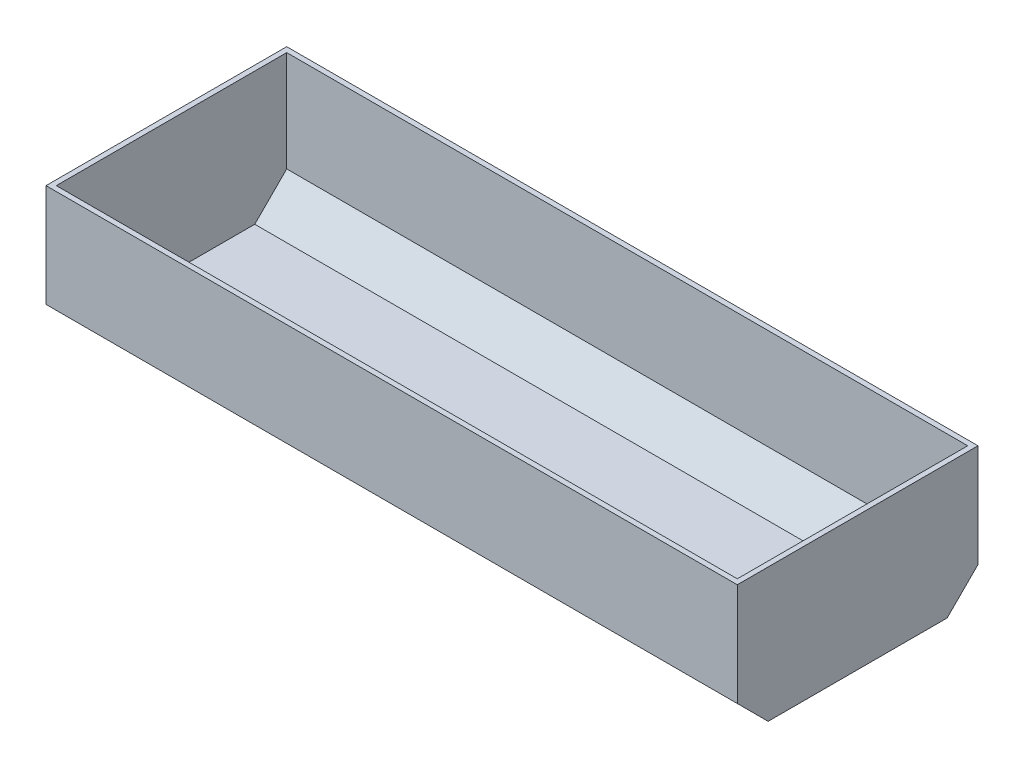
ISO-10303-21;
HEADER;
FILE_DESCRIPTION(('STEP AP214'),'2;1');
FILE_NAME('part.step','',(''),(''),'','','');
FILE_SCHEMA(('AUTOMOTIVE_DESIGN { 1 0 10303 214 1 1 1 1 }'));
ENDSEC;
DATA;
#1=APPLICATION_CONTEXT('core data for automotive mechanical design processes');
#2=APPLICATION_PROTOCOL_DEFINITION('international standard','automotive_design',2000,#1);
#3=PRODUCT_CONTEXT('',#1,'mechanical');
#4=PRODUCT('Part','Part','',(#3));
#5=PRODUCT_RELATED_PRODUCT_CATEGORY('part','',(#4));
#6=PRODUCT_DEFINITION_FORMATION('','',#4);
#7=PRODUCT_DEFINITION_CONTEXT('part definition',#1,'design');
#8=PRODUCT_DEFINITION('design','',#6,#7);
#9=PRODUCT_DEFINITION_SHAPE('','',#8);
#10=(LENGTH_UNIT() NAMED_UNIT(*) SI_UNIT(.MILLI.,.METRE.));
#11=(NAMED_UNIT(*) PLANE_ANGLE_UNIT() SI_UNIT($,.RADIAN.));
#12=(NAMED_UNIT(*) SI_UNIT($,.STERADIAN.) SOLID_ANGLE_UNIT());
#13=UNCERTAINTY_MEASURE_WITH_UNIT(LENGTH_MEASURE(1.E-05),#10,'distance_accuracy_value','');
#14=(GEOMETRIC_REPRESENTATION_CONTEXT(3) GLOBAL_UNCERTAINTY_ASSIGNED_CONTEXT((#13)) GLOBAL_UNIT_ASSIGNED_CONTEXT((#10,
#11,#12)) REPRESENTATION_CONTEXT('',''));
#15=CARTESIAN_POINT('',(0.,0.,0.));
#16=DIRECTION('',(0.,0.,1.));
#17=DIRECTION('',(1.,0.,0.));
#18=AXIS2_PLACEMENT_3D('',#15,#16,#17);
#19=CARTESIAN_POINT('',(3360.,1300.,-1170.));
#20=DIRECTION('',(-1.,0.,0.));
#21=DIRECTION('',(0.,0.,1.));
#22=AXIS2_PLACEMENT_3D('',#19,#20,#21);
#23=PLANE('',#22);
#24=DIRECTION('',(0.,0.,-1.));
#25=VECTOR('',#24,1.);
#26=CARTESIAN_POINT('',(3360.,0.,-1170.));
#27=LINE('',#26,#25);
#28=CARTESIAN_POINT('',(3360.,0.,869.999999999998));
#29=VERTEX_POINT('',#28);
#30=CARTESIAN_POINT('',(3360.,0.,-869.999999999999));
#31=VERTEX_POINT('',#30);
#32=EDGE_CURVE('E171',#29,#31,#27,.T.);
#33=ORIENTED_EDGE('',*,*,#32,.T.);
#34=DIRECTION('',(0.,-0.707106781186546,0.707106781186549));
#35=VECTOR('',#34,1.);
#36=CARTESIAN_POINT('',(3360.,300.,-1170.));
#37=LINE('',#36,#35);
#38=CARTESIAN_POINT('',(3360.,300.,-1170.));
#39=VERTEX_POINT('',#38);
#40=EDGE_CURVE('E45',#31,#39,#37,.F.);
#41=ORIENTED_EDGE('',*,*,#40,.T.);
#42=DIRECTION('',(0.,-1.,0.));
#43=VECTOR('',#42,1.);
#44=CARTESIAN_POINT('',(3360.,1300.,-1170.));
#45=LINE('',#44,#43);
#46=CARTESIAN_POINT('',(3360.,1300.,-1170.));
#47=VERTEX_POINT('',#46);
#48=EDGE_CURVE('E204',#47,#39,#45,.T.);
#49=ORIENTED_EDGE('',*,*,#48,.F.);
#50=DIRECTION('',(0.,0.,-1.));
#51=VECTOR('',#50,1.);
#52=CARTESIAN_POINT('',(3360.,1300.,-1170.));
#53=LINE('',#52,#51);
#54=CARTESIAN_POINT('',(3360.,1300.,1170.));
#55=VERTEX_POINT('',#54);
#56=EDGE_CURVE('E181',#55,#47,#53,.T.);
#57=ORIENTED_EDGE('',*,*,#56,.F.);
#58=DIRECTION('',(0.,-1.,0.));
#59=VECTOR('',#58,1.);
#60=CARTESIAN_POINT('',(3360.,1300.,1170.));
#61=LINE('',#60,#59);
#62=CARTESIAN_POINT('',(3360.,300.000000000001,1170.));
#63=VERTEX_POINT('',#62);
#64=EDGE_CURVE('E191',#55,#63,#61,.T.);
#65=ORIENTED_EDGE('',*,*,#64,.T.);
#66=DIRECTION('',(0.,0.707106781186546,0.707106781186549));
#67=VECTOR('',#66,1.);
#68=CARTESIAN_POINT('',(3360.,300.000000000001,1170.));
#69=LINE('',#68,#67);
#70=EDGE_CURVE('E60',#63,#29,#69,.F.);
#71=ORIENTED_EDGE('',*,*,#70,.T.);
#72=EDGE_LOOP('',(#33,#41,#49,#57,#65,#71));
#73=FACE_BOUND('',#72,.T.);
#74=ADVANCED_FACE('F36',(#73),#23,.F.);
#75=CARTESIAN_POINT('',(-3360.,1300.,-1170.));
#76=DIRECTION('',(0.,0.,1.));
#77=DIRECTION('',(1.,0.,0.));
#78=AXIS2_PLACEMENT_3D('',#75,#76,#77);
#79=PLANE('',#78);
#80=ORIENTED_EDGE('',*,*,#48,.T.);
#81=DIRECTION('',(-1.,0.,0.));
#82=VECTOR('',#81,1.);
#83=CARTESIAN_POINT('',(-3360.,300.,-1170.));
#84=LINE('',#83,#82);
#85=CARTESIAN_POINT('',(-3360.,300.,-1170.));
#86=VERTEX_POINT('',#85);
#87=EDGE_CURVE('E207',#39,#86,#84,.T.);
#88=ORIENTED_EDGE('',*,*,#87,.T.);
#89=DIRECTION('',(0.,-1.,0.));
#90=VECTOR('',#89,1.);
#91=CARTESIAN_POINT('',(-3360.,1300.,-1170.));
#92=LINE('',#91,#90);
#93=CARTESIAN_POINT('',(-3360.,1300.,-1170.));
#94=VERTEX_POINT('',#93);
#95=EDGE_CURVE('E201',#94,#86,#92,.T.);
#96=ORIENTED_EDGE('',*,*,#95,.F.);
#97=DIRECTION('',(-1.,0.,0.));
#98=VECTOR('',#97,1.);
#99=CARTESIAN_POINT('',(-3360.,1300.,-1170.));
#100=LINE('',#99,#98);
#101=EDGE_CURVE('E184',#47,#94,#100,.T.);
#102=ORIENTED_EDGE('',*,*,#101,.F.);
#103=EDGE_LOOP('',(#80,#88,#96,#102));
#104=FACE_BOUND('',#103,.T.);
#105=ADVANCED_FACE('F227',(#104),#79,.F.);
#106=CARTESIAN_POINT('',(-3360.,1300.,-1170.));
#107=DIRECTION('',(1.,0.,0.));
#108=DIRECTION('',(0.,0.,-1.));
#109=AXIS2_PLACEMENT_3D('',#106,#107,#108);
#110=PLANE('',#109);
#111=ORIENTED_EDGE('',*,*,#95,.T.);
#112=DIRECTION('',(0.,0.707106781186546,-0.707106781186549));
#113=VECTOR('',#112,1.);
#114=CARTESIAN_POINT('',(-3360.,300.,-1170.));
#115=LINE('',#114,#113);
#116=CARTESIAN_POINT('',(-3360.,0.,-869.999999999999));
#117=VERTEX_POINT('',#116);
#118=EDGE_CURVE('E212',#86,#117,#115,.F.);
#119=ORIENTED_EDGE('',*,*,#118,.T.);
#120=DIRECTION('',(0.,0.,1.));
#121=VECTOR('',#120,1.);
#122=CARTESIAN_POINT('',(-3360.,0.,-1170.));
#123=LINE('',#122,#121);
#124=CARTESIAN_POINT('',(-3360.,0.,869.999999999998));
#125=VERTEX_POINT('',#124);
#126=EDGE_CURVE('E185',#117,#125,#123,.T.);
#127=ORIENTED_EDGE('',*,*,#126,.T.);
#128=DIRECTION('',(0.,-0.707106781186546,-0.707106781186549));
#129=VECTOR('',#128,1.);
#130=CARTESIAN_POINT('',(-3360.,300.000000000001,1170.));
#131=LINE('',#130,#129);
#132=CARTESIAN_POINT('',(-3360.,300.000000000001,1170.));
#133=VERTEX_POINT('',#132);
#134=EDGE_CURVE('E210',#125,#133,#131,.F.);
#135=ORIENTED_EDGE('',*,*,#134,.T.);
#136=DIRECTION('',(0.,-1.,0.));
#137=VECTOR('',#136,1.);
#138=CARTESIAN_POINT('',(-3360.,1300.,1170.));
#139=LINE('',#138,#137);
#140=CARTESIAN_POINT('',(-3360.,1300.,1170.));
#141=VERTEX_POINT('',#140);
#142=EDGE_CURVE('E198',#141,#133,#139,.T.);
#143=ORIENTED_EDGE('',*,*,#142,.F.);
#144=DIRECTION('',(0.,0.,1.));
#145=VECTOR('',#144,1.);
#146=CARTESIAN_POINT('',(-3360.,1300.,-1170.));
#147=LINE('',#146,#145);
#148=EDGE_CURVE('E187',#94,#141,#147,.T.);
#149=ORIENTED_EDGE('',*,*,#148,.F.);
#150=EDGE_LOOP('',(#111,#119,#127,#135,#143,#149));
#151=FACE_BOUND('',#150,.T.);
#152=ADVANCED_FACE('F232',(#151),#110,.F.);
#153=CARTESIAN_POINT('',(-3360.,1300.,1170.));
#154=DIRECTION('',(0.,0.,-1.));
#155=DIRECTION('',(-1.,0.,0.));
#156=AXIS2_PLACEMENT_3D('',#153,#154,#155);
#157=PLANE('',#156);
#158=ORIENTED_EDGE('',*,*,#142,.T.);
#159=DIRECTION('',(1.,0.,0.));
#160=VECTOR('',#159,1.);
#161=CARTESIAN_POINT('',(-3360.,300.000000000001,1170.));
#162=LINE('',#161,#160);
#163=EDGE_CURVE('E11',#133,#63,#162,.T.);
#164=ORIENTED_EDGE('',*,*,#163,.T.);
#165=ORIENTED_EDGE('',*,*,#64,.F.);
#166=DIRECTION('',(1.,0.,0.));
#167=VECTOR('',#166,1.);
#168=CARTESIAN_POINT('',(-3360.,1300.,1170.));
#169=LINE('',#168,#167);
#170=EDGE_CURVE('E189',#141,#55,#169,.T.);
#171=ORIENTED_EDGE('',*,*,#170,.F.);
#172=EDGE_LOOP('',(#158,#164,#165,#171));
#173=FACE_BOUND('',#172,.T.);
#174=ADVANCED_FACE('F240',(#173),#157,.F.);
#175=CARTESIAN_POINT('',(0.,1300.,0.));
#176=DIRECTION('',(0.,1.,0.));
#177=DIRECTION('',(0.,0.,1.));
#178=AXIS2_PLACEMENT_3D('',#175,#176,#177);
#179=PLANE('',#178);
#180=DIRECTION('',(0.,0.,-1.));
#181=VECTOR('',#180,1.);
#182=CARTESIAN_POINT('',(3310.,1300.,-1170.));
#183=LINE('',#182,#181);
#184=CARTESIAN_POINT('',(3310.,1300.,1120.));
#185=VERTEX_POINT('',#184);
#186=CARTESIAN_POINT('',(3310.,1300.,-1120.));
#187=VERTEX_POINT('',#186);
#188=EDGE_CURVE('E146',#185,#187,#183,.T.);
#189=ORIENTED_EDGE('',*,*,#188,.F.);
#190=DIRECTION('',(1.,0.,0.));
#191=VECTOR('',#190,1.);
#192=CARTESIAN_POINT('',(-3360.,1300.,1120.));
#193=LINE('',#192,#191);
#194=CARTESIAN_POINT('',(-3310.,1300.,1120.));
#195=VERTEX_POINT('',#194);
#196=EDGE_CURVE('E179',#195,#185,#193,.T.);
#197=ORIENTED_EDGE('',*,*,#196,.F.);
#198=DIRECTION('',(0.,0.,1.));
#199=VECTOR('',#198,1.);
#200=CARTESIAN_POINT('',(-3310.,1300.,-1170.));
#201=LINE('',#200,#199);
#202=CARTESIAN_POINT('',(-3310.,1300.,-1120.));
#203=VERTEX_POINT('',#202);
#204=EDGE_CURVE('E177',#203,#195,#201,.T.);
#205=ORIENTED_EDGE('',*,*,#204,.F.);
#206=DIRECTION('',(-1.,0.,0.));
#207=VECTOR('',#206,1.);
#208=CARTESIAN_POINT('',(-3360.,1300.,-1120.));
#209=LINE('',#208,#207);
#210=EDGE_CURVE('E175',#187,#203,#209,.T.);
#211=ORIENTED_EDGE('',*,*,#210,.F.);
#212=EDGE_LOOP('',(#189,#197,#205,#211));
#213=FACE_BOUND('',#212,.T.);
#214=ORIENTED_EDGE('',*,*,#56,.T.);
#215=ORIENTED_EDGE('',*,*,#101,.T.);
#216=ORIENTED_EDGE('',*,*,#148,.T.);
#217=ORIENTED_EDGE('',*,*,#170,.T.);
#218=EDGE_LOOP('',(#214,#215,#216,#217));
#219=FACE_BOUND('',#218,.T.);
#220=ADVANCED_FACE('F243',(#213,#219),#179,.T.);
#221=CARTESIAN_POINT('',(0.,0.,0.));
#222=DIRECTION('',(0.,1.,0.));
#223=DIRECTION('',(0.,0.,1.));
#224=AXIS2_PLACEMENT_3D('',#221,#222,#223);
#225=PLANE('',#224);
#226=ORIENTED_EDGE('',*,*,#126,.F.);
#227=DIRECTION('',(1.,0.,0.));
#228=VECTOR('',#227,1.);
#229=CARTESIAN_POINT('',(0.,0.,-869.999999999999));
#230=LINE('',#229,#228);
#231=EDGE_CURVE('E216',#117,#31,#230,.T.);
#232=ORIENTED_EDGE('',*,*,#231,.T.);
#233=ORIENTED_EDGE('',*,*,#32,.F.);
#234=DIRECTION('',(-1.,0.,0.));
#235=VECTOR('',#234,1.);
#236=CARTESIAN_POINT('',(0.,0.,869.999999999998));
#237=LINE('',#236,#235);
#238=EDGE_CURVE('E214',#29,#125,#237,.T.);
#239=ORIENTED_EDGE('',*,*,#238,.T.);
#240=EDGE_LOOP('',(#226,#232,#233,#239));
#241=FACE_BOUND('',#240,.T.);
#242=ADVANCED_FACE('F236',(#241),#225,.F.);
#243=CARTESIAN_POINT('',(-3360.,300.,-1170.));
#244=DIRECTION('',(0.,0.707106781186549,0.707106781186546));
#245=DIRECTION('',(-1.,0.,0.));
#246=AXIS2_PLACEMENT_3D('',#243,#244,#245);
#247=PLANE('',#246);
#248=ORIENTED_EDGE('',*,*,#40,.F.);
#249=ORIENTED_EDGE('',*,*,#231,.F.);
#250=ORIENTED_EDGE('',*,*,#118,.F.);
#251=ORIENTED_EDGE('',*,*,#87,.F.);
#252=EDGE_LOOP('',(#248,#249,#250,#251));
#253=FACE_BOUND('',#252,.T.);
#254=ADVANCED_FACE('F229',(#253),#247,.F.);
#255=CARTESIAN_POINT('',(-3360.,300.000000000001,1170.));
#256=DIRECTION('',(0.,0.707106781186549,-0.707106781186547));
#257=DIRECTION('',(1.,0.,0.));
#258=AXIS2_PLACEMENT_3D('',#255,#256,#257);
#259=PLANE('',#258);
#260=ORIENTED_EDGE('',*,*,#134,.F.);
#261=ORIENTED_EDGE('',*,*,#238,.F.);
#262=ORIENTED_EDGE('',*,*,#70,.F.);
#263=ORIENTED_EDGE('',*,*,#163,.F.);
#264=EDGE_LOOP('',(#260,#261,#262,#263));
#265=FACE_BOUND('',#264,.T.);
#266=ADVANCED_FACE('F39',(#265),#259,.F.);
#267=CARTESIAN_POINT('',(3310.,1300.,-1170.));
#268=DIRECTION('',(-1.,0.,0.));
#269=DIRECTION('',(0.,0.,1.));
#270=AXIS2_PLACEMENT_3D('',#267,#268,#269);
#271=PLANE('',#270);
#272=DIRECTION('',(0.,0.,-1.));
#273=VECTOR('',#272,1.);
#274=CARTESIAN_POINT('',(3310.,10.,-1170.));
#275=LINE('',#274,#273);
#276=CARTESIAN_POINT('',(3310.,10.,809.289321881343));
#277=VERTEX_POINT('',#276);
#278=CARTESIAN_POINT('',(3310.,10.,-809.289321881345));
#279=VERTEX_POINT('',#278);
#280=EDGE_CURVE('E165',#277,#279,#275,.T.);
#281=ORIENTED_EDGE('',*,*,#280,.F.);
#282=DIRECTION('',(0.,0.707106781186546,0.707106781186549));
#283=VECTOR('',#282,1.);
#284=CARTESIAN_POINT('',(3310.,335.355339059328,1134.64466094067));
#285=LINE('',#284,#283);
#286=CARTESIAN_POINT('',(3310.,320.710678118655,1120.));
#287=VERTEX_POINT('',#286);
#288=EDGE_CURVE('E139',#287,#277,#285,.F.);
#289=ORIENTED_EDGE('',*,*,#288,.F.);
#290=DIRECTION('',(0.,-1.,0.));
#291=VECTOR('',#290,1.);
#292=CARTESIAN_POINT('',(3310.,1300.,1120.));
#293=LINE('',#292,#291);
#294=EDGE_CURVE('E168',#185,#287,#293,.T.);
#295=ORIENTED_EDGE('',*,*,#294,.F.);
#296=ORIENTED_EDGE('',*,*,#188,.T.);
#297=DIRECTION('',(0.,-1.,0.));
#298=VECTOR('',#297,1.);
#299=CARTESIAN_POINT('',(3310.,1300.,-1120.));
#300=LINE('',#299,#298);
#301=CARTESIAN_POINT('',(3310.,320.710678118655,-1120.));
#302=VERTEX_POINT('',#301);
#303=EDGE_CURVE('E142',#187,#302,#300,.T.);
#304=ORIENTED_EDGE('',*,*,#303,.T.);
#305=DIRECTION('',(0.,-0.707106781186546,0.707106781186549));
#306=VECTOR('',#305,1.);
#307=CARTESIAN_POINT('',(3310.,335.355339059327,-1134.64466094067));
#308=LINE('',#307,#306);
#309=EDGE_CURVE('E127',#279,#302,#308,.F.);
#310=ORIENTED_EDGE('',*,*,#309,.F.);
#311=EDGE_LOOP('',(#281,#289,#295,#296,#304,#310));
#312=FACE_BOUND('',#311,.T.);
#313=ADVANCED_FACE('F143',(#312),#271,.T.);
#314=CARTESIAN_POINT('',(-3360.,1300.,-1120.));
#315=DIRECTION('',(0.,0.,1.));
#316=DIRECTION('',(1.,0.,0.));
#317=AXIS2_PLACEMENT_3D('',#314,#315,#316);
#318=PLANE('',#317);
#319=ORIENTED_EDGE('',*,*,#303,.F.);
#320=ORIENTED_EDGE('',*,*,#210,.T.);
#321=DIRECTION('',(0.,-1.,0.));
#322=VECTOR('',#321,1.);
#323=CARTESIAN_POINT('',(-3310.,1300.,-1120.));
#324=LINE('',#323,#322);
#325=CARTESIAN_POINT('',(-3310.,320.710678118655,-1120.));
#326=VERTEX_POINT('',#325);
#327=EDGE_CURVE('E149',#203,#326,#324,.T.);
#328=ORIENTED_EDGE('',*,*,#327,.T.);
#329=DIRECTION('',(1.,0.,0.));
#330=VECTOR('',#329,1.);
#331=CARTESIAN_POINT('',(-3360.,320.710678118655,-1120.));
#332=LINE('',#331,#330);
#333=EDGE_CURVE('E131',#302,#326,#332,.F.);
#334=ORIENTED_EDGE('',*,*,#333,.F.);
#335=EDGE_LOOP('',(#319,#320,#328,#334));
#336=FACE_BOUND('',#335,.T.);
#337=ADVANCED_FACE('F151',(#336),#318,.T.);
#338=CARTESIAN_POINT('',(-3310.,1300.,-1170.));
#339=DIRECTION('',(1.,0.,0.));
#340=DIRECTION('',(0.,0.,-1.));
#341=AXIS2_PLACEMENT_3D('',#338,#339,#340);
#342=PLANE('',#341);
#343=ORIENTED_EDGE('',*,*,#327,.F.);
#344=ORIENTED_EDGE('',*,*,#204,.T.);
#345=DIRECTION('',(0.,-1.,0.));
#346=VECTOR('',#345,1.);
#347=CARTESIAN_POINT('',(-3310.,1300.,1120.));
#348=LINE('',#347,#346);
#349=CARTESIAN_POINT('',(-3310.,320.710678118655,1120.));
#350=VERTEX_POINT('',#349);
#351=EDGE_CURVE('E52',#195,#350,#348,.T.);
#352=ORIENTED_EDGE('',*,*,#351,.T.);
#353=DIRECTION('',(0.,-0.707106781186546,-0.707106781186549));
#354=VECTOR('',#353,1.);
#355=CARTESIAN_POINT('',(-3310.,335.355339059328,1134.64466094067));
#356=LINE('',#355,#354);
#357=CARTESIAN_POINT('',(-3310.,10.,809.289321881343));
#358=VERTEX_POINT('',#357);
#359=EDGE_CURVE('E153',#358,#350,#356,.F.);
#360=ORIENTED_EDGE('',*,*,#359,.F.);
#361=DIRECTION('',(0.,0.,1.));
#362=VECTOR('',#361,1.);
#363=CARTESIAN_POINT('',(-3310.,10.,-1170.));
#364=LINE('',#363,#362);
#365=CARTESIAN_POINT('',(-3310.,10.,-809.289321881345));
#366=VERTEX_POINT('',#365);
#367=EDGE_CURVE('E163',#366,#358,#364,.T.);
#368=ORIENTED_EDGE('',*,*,#367,.F.);
#369=DIRECTION('',(0.,0.707106781186546,-0.707106781186549));
#370=VECTOR('',#369,1.);
#371=CARTESIAN_POINT('',(-3310.,335.355339059327,-1134.64466094067));
#372=LINE('',#371,#370);
#373=EDGE_CURVE('E155',#326,#366,#372,.F.);
#374=ORIENTED_EDGE('',*,*,#373,.F.);
#375=EDGE_LOOP('',(#343,#344,#352,#360,#368,#374));
#376=FACE_BOUND('',#375,.T.);
#377=ADVANCED_FACE('F275',(#376),#342,.T.);
#378=CARTESIAN_POINT('',(-3360.,1300.,1120.));
#379=DIRECTION('',(0.,0.,-1.));
#380=DIRECTION('',(-1.,0.,0.));
#381=AXIS2_PLACEMENT_3D('',#378,#379,#380);
#382=PLANE('',#381);
#383=ORIENTED_EDGE('',*,*,#351,.F.);
#384=ORIENTED_EDGE('',*,*,#196,.T.);
#385=ORIENTED_EDGE('',*,*,#294,.T.);
#386=DIRECTION('',(-1.,0.,0.));
#387=VECTOR('',#386,1.);
#388=CARTESIAN_POINT('',(-3360.,320.710678118655,1120.));
#389=LINE('',#388,#387);
#390=EDGE_CURVE('E138',#350,#287,#389,.F.);
#391=ORIENTED_EDGE('',*,*,#390,.F.);
#392=EDGE_LOOP('',(#383,#384,#385,#391));
#393=FACE_BOUND('',#392,.T.);
#394=ADVANCED_FACE('F280',(#393),#382,.T.);
#395=CARTESIAN_POINT('',(0.,10.,0.));
#396=DIRECTION('',(0.,1.,0.));
#397=DIRECTION('',(0.,0.,1.));
#398=AXIS2_PLACEMENT_3D('',#395,#396,#397);
#399=PLANE('',#398);
#400=ORIENTED_EDGE('',*,*,#367,.T.);
#401=DIRECTION('',(1.,0.,0.));
#402=VECTOR('',#401,1.);
#403=CARTESIAN_POINT('',(-3360.,10.,809.289321881343));
#404=LINE('',#403,#402);
#405=EDGE_CURVE('E162',#277,#358,#404,.F.);
#406=ORIENTED_EDGE('',*,*,#405,.F.);
#407=ORIENTED_EDGE('',*,*,#280,.T.);
#408=DIRECTION('',(-1.,0.,0.));
#409=VECTOR('',#408,1.);
#410=CARTESIAN_POINT('',(-3360.,10.,-809.289321881345));
#411=LINE('',#410,#409);
#412=EDGE_CURVE('E134',#366,#279,#411,.F.);
#413=ORIENTED_EDGE('',*,*,#412,.F.);
#414=EDGE_LOOP('',(#400,#406,#407,#413));
#415=FACE_BOUND('',#414,.T.);
#416=ADVANCED_FACE('F284',(#415),#399,.T.);
#417=CARTESIAN_POINT('',(-3360.,335.355339059327,-1134.64466094067));
#418=DIRECTION('',(0.,0.707106781186549,0.707106781186546));
#419=DIRECTION('',(-1.,0.,0.));
#420=AXIS2_PLACEMENT_3D('',#417,#418,#419);
#421=PLANE('',#420);
#422=ORIENTED_EDGE('',*,*,#309,.T.);
#423=ORIENTED_EDGE('',*,*,#333,.T.);
#424=ORIENTED_EDGE('',*,*,#373,.T.);
#425=ORIENTED_EDGE('',*,*,#412,.T.);
#426=EDGE_LOOP('',(#422,#423,#424,#425));
#427=FACE_BOUND('',#426,.T.);
#428=ADVANCED_FACE('F129',(#427),#421,.T.);
#429=CARTESIAN_POINT('',(-3360.,335.355339059328,1134.64466094067));
#430=DIRECTION('',(0.,0.707106781186549,-0.707106781186547));
#431=DIRECTION('',(1.,0.,0.));
#432=AXIS2_PLACEMENT_3D('',#429,#430,#431);
#433=PLANE('',#432);
#434=ORIENTED_EDGE('',*,*,#359,.T.);
#435=ORIENTED_EDGE('',*,*,#390,.T.);
#436=ORIENTED_EDGE('',*,*,#288,.T.);
#437=ORIENTED_EDGE('',*,*,#405,.T.);
#438=EDGE_LOOP('',(#434,#435,#436,#437));
#439=FACE_BOUND('',#438,.T.);
#440=ADVANCED_FACE('F289',(#439),#433,.T.);
#441=CLOSED_SHELL('',(#74,#105,#152,#174,#220,#242,#254,#266,#313,#337,#377,#394,#416,#428,#440));
#442=MANIFOLD_SOLID_BREP('B2',#441);
#443=ADVANCED_BREP_SHAPE_REPRESENTATION('',(#18,#442),#14);
#444=SHAPE_DEFINITION_REPRESENTATION(#9,#443);
ENDSEC;
END-ISO-10303-21;
